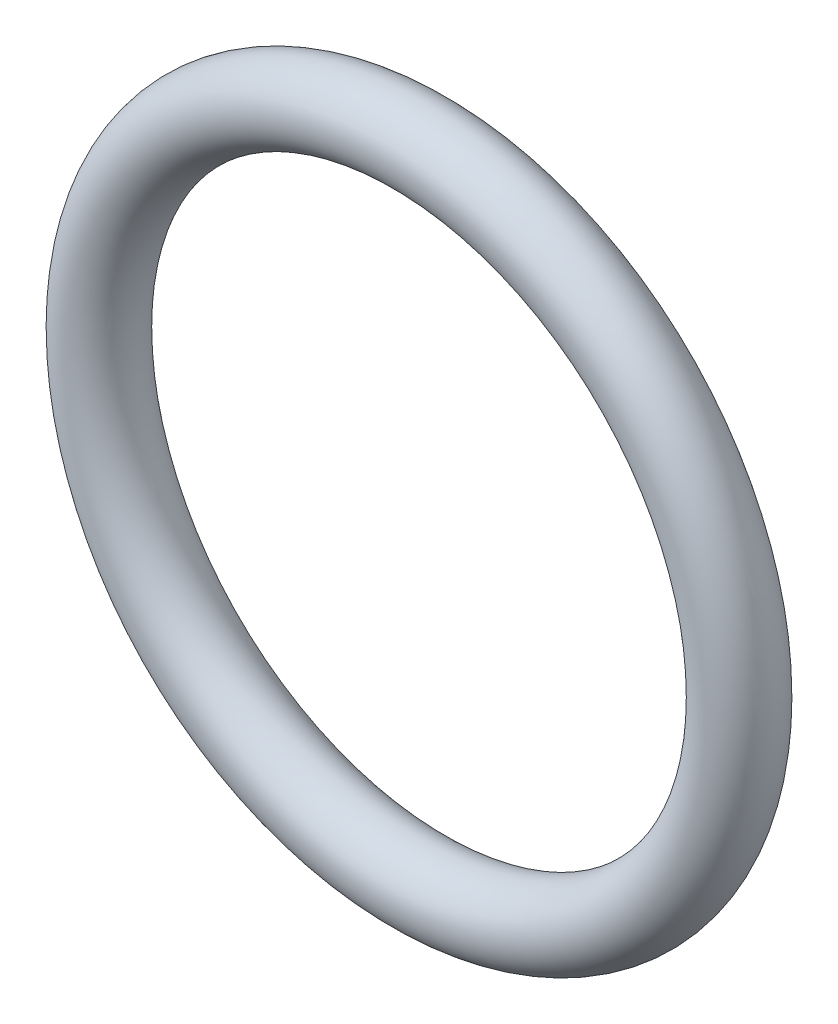
ISO-10303-21;
HEADER;
FILE_DESCRIPTION(('STEP AP214'),'2;1');
FILE_NAME('part.step','',(''),(''),'','','');
FILE_SCHEMA(('AUTOMOTIVE_DESIGN { 1 0 10303 214 1 1 1 1 }'));
ENDSEC;
DATA;
#1=APPLICATION_CONTEXT('core data for automotive mechanical design processes');
#2=APPLICATION_PROTOCOL_DEFINITION('international standard','automotive_design',2000,#1);
#3=PRODUCT_CONTEXT('',#1,'mechanical');
#4=PRODUCT('Part','Part','',(#3));
#5=PRODUCT_RELATED_PRODUCT_CATEGORY('part','',(#4));
#6=PRODUCT_DEFINITION_FORMATION('','',#4);
#7=PRODUCT_DEFINITION_CONTEXT('part definition',#1,'design');
#8=PRODUCT_DEFINITION('design','',#6,#7);
#9=PRODUCT_DEFINITION_SHAPE('','',#8);
#10=(LENGTH_UNIT() NAMED_UNIT(*) SI_UNIT(.MILLI.,.METRE.));
#11=(NAMED_UNIT(*) PLANE_ANGLE_UNIT() SI_UNIT($,.RADIAN.));
#12=(NAMED_UNIT(*) SI_UNIT($,.STERADIAN.) SOLID_ANGLE_UNIT());
#13=UNCERTAINTY_MEASURE_WITH_UNIT(LENGTH_MEASURE(1.E-05),#10,'distance_accuracy_value','');
#14=(GEOMETRIC_REPRESENTATION_CONTEXT(3) GLOBAL_UNCERTAINTY_ASSIGNED_CONTEXT((#13)) GLOBAL_UNIT_ASSIGNED_CONTEXT((#10,
#11,#12)) REPRESENTATION_CONTEXT('',''));
#15=CARTESIAN_POINT('',(0.,0.,0.));
#16=DIRECTION('',(0.,0.,1.));
#17=DIRECTION('',(1.,0.,0.));
#18=AXIS2_PLACEMENT_3D('',#15,#16,#17);
#19=CARTESIAN_POINT('',(0.,0.,0.));
#20=DIRECTION('',(0.,0.,1.));
#21=DIRECTION('',(1.,0.,0.));
#22=AXIS2_PLACEMENT_3D('',#19,#20,#21);
#23=TOROIDAL_SURFACE('',#22,15.,1.75);
#24=CARTESIAN_POINT('',(16.75,0.,0.));
#25=VERTEX_POINT('',#24);
#26=VERTEX_LOOP('',#25);
#27=FACE_BOUND('',#26,.T.);
#28=ADVANCED_FACE('F27',(#27),#23,.T.);
#29=CLOSED_SHELL('',(#28));
#30=MANIFOLD_SOLID_BREP('B2',#29);
#31=ADVANCED_BREP_SHAPE_REPRESENTATION('',(#18,#30),#14);
#32=SHAPE_DEFINITION_REPRESENTATION(#9,#31);
ENDSEC;
END-ISO-10303-21;
